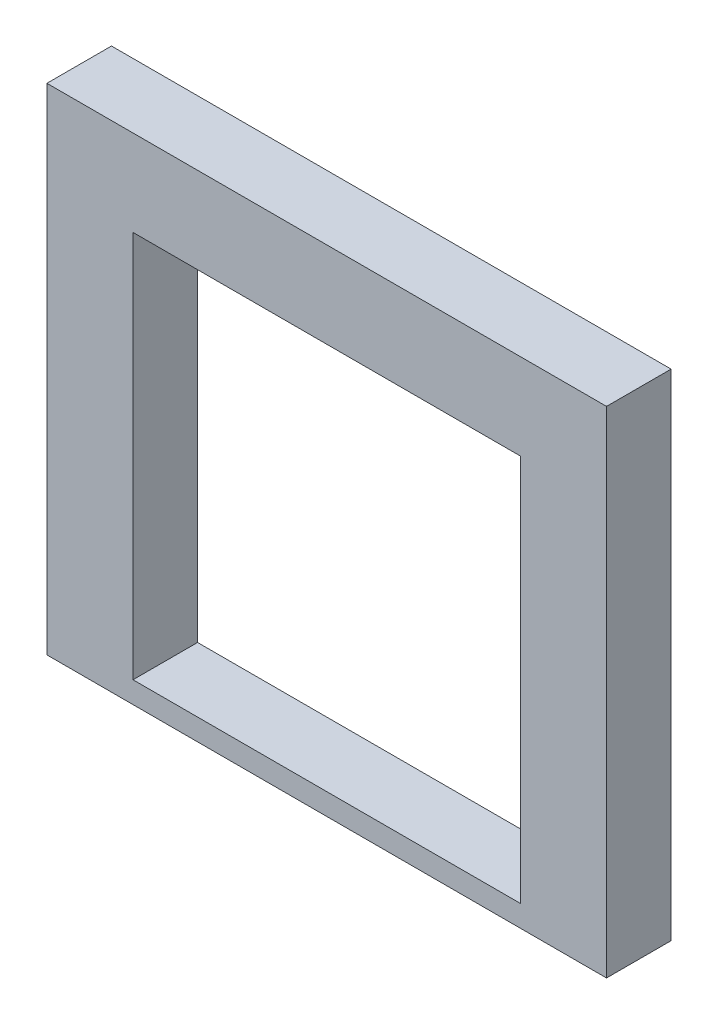
ISO-10303-21;
HEADER;
FILE_DESCRIPTION(('STEP AP214'),'2;1');
FILE_NAME('part.step','',(''),(''),'','','');
FILE_SCHEMA(('AUTOMOTIVE_DESIGN { 1 0 10303 214 1 1 1 1 }'));
ENDSEC;
DATA;
#1=APPLICATION_CONTEXT('core data for automotive mechanical design processes');
#2=APPLICATION_PROTOCOL_DEFINITION('international standard','automotive_design',2000,#1);
#3=PRODUCT_CONTEXT('',#1,'mechanical');
#4=PRODUCT('Part','Part','',(#3));
#5=PRODUCT_RELATED_PRODUCT_CATEGORY('part','',(#4));
#6=PRODUCT_DEFINITION_FORMATION('','',#4);
#7=PRODUCT_DEFINITION_CONTEXT('part definition',#1,'design');
#8=PRODUCT_DEFINITION('design','',#6,#7);
#9=PRODUCT_DEFINITION_SHAPE('','',#8);
#10=(LENGTH_UNIT() NAMED_UNIT(*) SI_UNIT(.MILLI.,.METRE.));
#11=(NAMED_UNIT(*) PLANE_ANGLE_UNIT() SI_UNIT($,.RADIAN.));
#12=(NAMED_UNIT(*) SI_UNIT($,.STERADIAN.) SOLID_ANGLE_UNIT());
#13=UNCERTAINTY_MEASURE_WITH_UNIT(LENGTH_MEASURE(1.E-05),#10,'distance_accuracy_value','');
#14=(GEOMETRIC_REPRESENTATION_CONTEXT(3) GLOBAL_UNCERTAINTY_ASSIGNED_CONTEXT((#13)) GLOBAL_UNIT_ASSIGNED_CONTEXT((#10,
#11,#12)) REPRESENTATION_CONTEXT('',''));
#15=CARTESIAN_POINT('',(0.,0.,0.));
#16=DIRECTION('',(0.,0.,1.));
#17=DIRECTION('',(1.,0.,0.));
#18=AXIS2_PLACEMENT_3D('',#15,#16,#17);
#19=CARTESIAN_POINT('',(0.,0.,1.5));
#20=DIRECTION('',(0.,0.,1.));
#21=DIRECTION('',(1.,0.,0.));
#22=AXIS2_PLACEMENT_3D('',#19,#20,#21);
#23=PLANE('',#22);
#24=DIRECTION('',(0.,-1.,0.));
#25=VECTOR('',#24,1.);
#26=CARTESIAN_POINT('',(-6.5,-5.,1.5));
#27=LINE('',#26,#25);
#28=CARTESIAN_POINT('',(-6.5,6.5,1.5));
#29=VERTEX_POINT('',#28);
#30=CARTESIAN_POINT('',(-6.5,-5.,1.5));
#31=VERTEX_POINT('',#30);
#32=EDGE_CURVE('E134',#29,#31,#27,.T.);
#33=ORIENTED_EDGE('',*,*,#32,.T.);
#34=DIRECTION('',(1.,0.,0.));
#35=VECTOR('',#34,1.);
#36=CARTESIAN_POINT('',(6.5,-5.,1.5));
#37=LINE('',#36,#35);
#38=CARTESIAN_POINT('',(6.5,-5.,1.5));
#39=VERTEX_POINT('',#38);
#40=EDGE_CURVE('E137',#31,#39,#37,.T.);
#41=ORIENTED_EDGE('',*,*,#40,.T.);
#42=DIRECTION('',(0.,1.,0.));
#43=VECTOR('',#42,1.);
#44=CARTESIAN_POINT('',(6.5,-5.,1.5));
#45=LINE('',#44,#43);
#46=CARTESIAN_POINT('',(6.5,6.5,1.5));
#47=VERTEX_POINT('',#46);
#48=EDGE_CURVE('E140',#39,#47,#45,.T.);
#49=ORIENTED_EDGE('',*,*,#48,.T.);
#50=DIRECTION('',(-1.,0.,0.));
#51=VECTOR('',#50,1.);
#52=CARTESIAN_POINT('',(6.5,6.5,1.5));
#53=LINE('',#52,#51);
#54=EDGE_CURVE('E142',#47,#29,#53,.T.);
#55=ORIENTED_EDGE('',*,*,#54,.T.);
#56=EDGE_LOOP('',(#33,#41,#49,#55));
#57=FACE_BOUND('',#56,.T.);
#58=DIRECTION('',(1.,0.,0.));
#59=VECTOR('',#58,1.);
#60=CARTESIAN_POINT('',(4.5,-4.5,1.5));
#61=LINE('',#60,#59);
#62=CARTESIAN_POINT('',(-4.5,-4.5,1.5));
#63=VERTEX_POINT('',#62);
#64=CARTESIAN_POINT('',(4.5,-4.5,1.5));
#65=VERTEX_POINT('',#64);
#66=EDGE_CURVE('E106',#63,#65,#61,.T.);
#67=ORIENTED_EDGE('',*,*,#66,.F.);
#68=DIRECTION('',(0.,-1.,0.));
#69=VECTOR('',#68,1.);
#70=CARTESIAN_POINT('',(-4.5,-4.5,1.5));
#71=LINE('',#70,#69);
#72=CARTESIAN_POINT('',(-4.5,4.5,1.5));
#73=VERTEX_POINT('',#72);
#74=EDGE_CURVE('E98',#73,#63,#71,.T.);
#75=ORIENTED_EDGE('',*,*,#74,.F.);
#76=DIRECTION('',(-1.,0.,0.));
#77=VECTOR('',#76,1.);
#78=CARTESIAN_POINT('',(4.5,4.5,1.5));
#79=LINE('',#78,#77);
#80=CARTESIAN_POINT('',(4.5,4.5,1.5));
#81=VERTEX_POINT('',#80);
#82=EDGE_CURVE('E120',#81,#73,#79,.T.);
#83=ORIENTED_EDGE('',*,*,#82,.F.);
#84=DIRECTION('',(0.,1.,0.));
#85=VECTOR('',#84,1.);
#86=CARTESIAN_POINT('',(4.5,-4.5,1.5));
#87=LINE('',#86,#85);
#88=EDGE_CURVE('E118',#65,#81,#87,.T.);
#89=ORIENTED_EDGE('',*,*,#88,.F.);
#90=EDGE_LOOP('',(#67,#75,#83,#89));
#91=FACE_BOUND('',#90,.T.);
#92=ADVANCED_FACE('F33',(#57,#91),#23,.T.);
#93=CARTESIAN_POINT('',(0.,0.,0.));
#94=DIRECTION('',(0.,0.,1.));
#95=DIRECTION('',(1.,0.,0.));
#96=AXIS2_PLACEMENT_3D('',#93,#94,#95);
#97=PLANE('',#96);
#98=DIRECTION('',(0.,-1.,0.));
#99=VECTOR('',#98,1.);
#100=CARTESIAN_POINT('',(-6.5,-5.,0.));
#101=LINE('',#100,#99);
#102=CARTESIAN_POINT('',(-6.5,6.5,0.));
#103=VERTEX_POINT('',#102);
#104=CARTESIAN_POINT('',(-6.5,-5.,0.));
#105=VERTEX_POINT('',#104);
#106=EDGE_CURVE('E114',#103,#105,#101,.T.);
#107=ORIENTED_EDGE('',*,*,#106,.F.);
#108=DIRECTION('',(-1.,0.,0.));
#109=VECTOR('',#108,1.);
#110=CARTESIAN_POINT('',(6.5,6.5,0.));
#111=LINE('',#110,#109);
#112=CARTESIAN_POINT('',(6.5,6.5,0.));
#113=VERTEX_POINT('',#112);
#114=EDGE_CURVE('E138',#113,#103,#111,.T.);
#115=ORIENTED_EDGE('',*,*,#114,.F.);
#116=DIRECTION('',(0.,1.,0.));
#117=VECTOR('',#116,1.);
#118=CARTESIAN_POINT('',(6.5,-5.,0.));
#119=LINE('',#118,#117);
#120=CARTESIAN_POINT('',(6.5,-5.,0.));
#121=VERTEX_POINT('',#120);
#122=EDGE_CURVE('E149',#121,#113,#119,.T.);
#123=ORIENTED_EDGE('',*,*,#122,.F.);
#124=DIRECTION('',(1.,0.,0.));
#125=VECTOR('',#124,1.);
#126=CARTESIAN_POINT('',(6.5,-5.,0.));
#127=LINE('',#126,#125);
#128=EDGE_CURVE('E147',#105,#121,#127,.T.);
#129=ORIENTED_EDGE('',*,*,#128,.F.);
#130=EDGE_LOOP('',(#107,#115,#123,#129));
#131=FACE_BOUND('',#130,.T.);
#132=DIRECTION('',(0.,-1.,0.));
#133=VECTOR('',#132,1.);
#134=CARTESIAN_POINT('',(-4.5,-4.5,0.));
#135=LINE('',#134,#133);
#136=CARTESIAN_POINT('',(-4.5,4.5,0.));
#137=VERTEX_POINT('',#136);
#138=CARTESIAN_POINT('',(-4.5,-4.5,0.));
#139=VERTEX_POINT('',#138);
#140=EDGE_CURVE('E56',#137,#139,#135,.T.);
#141=ORIENTED_EDGE('',*,*,#140,.T.);
#142=DIRECTION('',(1.,0.,0.));
#143=VECTOR('',#142,1.);
#144=CARTESIAN_POINT('',(4.5,-4.5,0.));
#145=LINE('',#144,#143);
#146=CARTESIAN_POINT('',(4.5,-4.5,0.));
#147=VERTEX_POINT('',#146);
#148=EDGE_CURVE('E113',#139,#147,#145,.T.);
#149=ORIENTED_EDGE('',*,*,#148,.T.);
#150=DIRECTION('',(0.,1.,0.));
#151=VECTOR('',#150,1.);
#152=CARTESIAN_POINT('',(4.5,-4.5,0.));
#153=LINE('',#152,#151);
#154=CARTESIAN_POINT('',(4.5,4.5,0.));
#155=VERTEX_POINT('',#154);
#156=EDGE_CURVE('E126',#147,#155,#153,.T.);
#157=ORIENTED_EDGE('',*,*,#156,.T.);
#158=DIRECTION('',(-1.,0.,0.));
#159=VECTOR('',#158,1.);
#160=CARTESIAN_POINT('',(4.5,4.5,0.));
#161=LINE('',#160,#159);
#162=EDGE_CURVE('E107',#155,#137,#161,.T.);
#163=ORIENTED_EDGE('',*,*,#162,.T.);
#164=EDGE_LOOP('',(#141,#149,#157,#163));
#165=FACE_BOUND('',#164,.T.);
#166=ADVANCED_FACE('F167',(#131,#165),#97,.F.);
#167=CARTESIAN_POINT('',(-6.5,-5.,1.5));
#168=DIRECTION('',(1.,0.,0.));
#169=DIRECTION('',(0.,0.,-1.));
#170=AXIS2_PLACEMENT_3D('',#167,#168,#169);
#171=PLANE('',#170);
#172=ORIENTED_EDGE('',*,*,#106,.T.);
#173=DIRECTION('',(0.,0.,-1.));
#174=VECTOR('',#173,1.);
#175=CARTESIAN_POINT('',(-6.5,-5.,1.5));
#176=LINE('',#175,#174);
#177=EDGE_CURVE('E11',#31,#105,#176,.T.);
#178=ORIENTED_EDGE('',*,*,#177,.F.);
#179=ORIENTED_EDGE('',*,*,#32,.F.);
#180=DIRECTION('',(0.,0.,-1.));
#181=VECTOR('',#180,1.);
#182=CARTESIAN_POINT('',(-6.5,6.5,1.5));
#183=LINE('',#182,#181);
#184=EDGE_CURVE('E144',#29,#103,#183,.T.);
#185=ORIENTED_EDGE('',*,*,#184,.T.);
#186=EDGE_LOOP('',(#172,#178,#179,#185));
#187=FACE_BOUND('',#186,.T.);
#188=ADVANCED_FACE('F35',(#187),#171,.F.);
#189=CARTESIAN_POINT('',(6.5,-5.,1.5));
#190=DIRECTION('',(0.,1.,0.));
#191=DIRECTION('',(-1.,0.,0.));
#192=AXIS2_PLACEMENT_3D('',#189,#190,#191);
#193=PLANE('',#192);
#194=ORIENTED_EDGE('',*,*,#128,.T.);
#195=DIRECTION('',(0.,0.,-1.));
#196=VECTOR('',#195,1.);
#197=CARTESIAN_POINT('',(6.5,-5.,1.5));
#198=LINE('',#197,#196);
#199=EDGE_CURVE('E41',#39,#121,#198,.T.);
#200=ORIENTED_EDGE('',*,*,#199,.F.);
#201=ORIENTED_EDGE('',*,*,#40,.F.);
#202=ORIENTED_EDGE('',*,*,#177,.T.);
#203=EDGE_LOOP('',(#194,#200,#201,#202));
#204=FACE_BOUND('',#203,.T.);
#205=ADVANCED_FACE('F177',(#204),#193,.F.);
#206=CARTESIAN_POINT('',(6.5,-5.,1.5));
#207=DIRECTION('',(-1.,0.,0.));
#208=DIRECTION('',(0.,0.,1.));
#209=AXIS2_PLACEMENT_3D('',#206,#207,#208);
#210=PLANE('',#209);
#211=ORIENTED_EDGE('',*,*,#122,.T.);
#212=DIRECTION('',(0.,0.,-1.));
#213=VECTOR('',#212,1.);
#214=CARTESIAN_POINT('',(6.5,6.5,1.5));
#215=LINE('',#214,#213);
#216=EDGE_CURVE('E154',#47,#113,#215,.T.);
#217=ORIENTED_EDGE('',*,*,#216,.F.);
#218=ORIENTED_EDGE('',*,*,#48,.F.);
#219=ORIENTED_EDGE('',*,*,#199,.T.);
#220=EDGE_LOOP('',(#211,#217,#218,#219));
#221=FACE_BOUND('',#220,.T.);
#222=ADVANCED_FACE('F161',(#221),#210,.F.);
#223=CARTESIAN_POINT('',(6.5,6.5,1.5));
#224=DIRECTION('',(0.,-1.,0.));
#225=DIRECTION('',(0.,0.,-1.));
#226=AXIS2_PLACEMENT_3D('',#223,#224,#225);
#227=PLANE('',#226);
#228=ORIENTED_EDGE('',*,*,#114,.T.);
#229=ORIENTED_EDGE('',*,*,#184,.F.);
#230=ORIENTED_EDGE('',*,*,#54,.F.);
#231=ORIENTED_EDGE('',*,*,#216,.T.);
#232=EDGE_LOOP('',(#228,#229,#230,#231));
#233=FACE_BOUND('',#232,.T.);
#234=ADVANCED_FACE('F171',(#233),#227,.F.);
#235=CARTESIAN_POINT('',(-4.5,-4.5,1.5));
#236=DIRECTION('',(1.,0.,0.));
#237=DIRECTION('',(0.,0.,-1.));
#238=AXIS2_PLACEMENT_3D('',#235,#236,#237);
#239=PLANE('',#238);
#240=ORIENTED_EDGE('',*,*,#140,.F.);
#241=DIRECTION('',(0.,0.,-1.));
#242=VECTOR('',#241,1.);
#243=CARTESIAN_POINT('',(-4.5,4.5,1.5));
#244=LINE('',#243,#242);
#245=EDGE_CURVE('E102',#73,#137,#244,.T.);
#246=ORIENTED_EDGE('',*,*,#245,.F.);
#247=ORIENTED_EDGE('',*,*,#74,.T.);
#248=DIRECTION('',(0.,0.,-1.));
#249=VECTOR('',#248,1.);
#250=CARTESIAN_POINT('',(-4.5,-4.5,1.5));
#251=LINE('',#250,#249);
#252=EDGE_CURVE('E101',#63,#139,#251,.T.);
#253=ORIENTED_EDGE('',*,*,#252,.T.);
#254=EDGE_LOOP('',(#240,#246,#247,#253));
#255=FACE_BOUND('',#254,.T.);
#256=ADVANCED_FACE('F100',(#255),#239,.T.);
#257=CARTESIAN_POINT('',(4.5,-4.5,1.5));
#258=DIRECTION('',(0.,1.,0.));
#259=DIRECTION('',(-1.,0.,0.));
#260=AXIS2_PLACEMENT_3D('',#257,#258,#259);
#261=PLANE('',#260);
#262=ORIENTED_EDGE('',*,*,#148,.F.);
#263=ORIENTED_EDGE('',*,*,#252,.F.);
#264=ORIENTED_EDGE('',*,*,#66,.T.);
#265=DIRECTION('',(0.,0.,-1.));
#266=VECTOR('',#265,1.);
#267=CARTESIAN_POINT('',(4.5,-4.5,1.5));
#268=LINE('',#267,#266);
#269=EDGE_CURVE('E115',#65,#147,#268,.T.);
#270=ORIENTED_EDGE('',*,*,#269,.T.);
#271=EDGE_LOOP('',(#262,#263,#264,#270));
#272=FACE_BOUND('',#271,.T.);
#273=ADVANCED_FACE('F110',(#272),#261,.T.);
#274=CARTESIAN_POINT('',(4.5,-4.5,1.5));
#275=DIRECTION('',(-1.,0.,0.));
#276=DIRECTION('',(0.,0.,1.));
#277=AXIS2_PLACEMENT_3D('',#274,#275,#276);
#278=PLANE('',#277);
#279=ORIENTED_EDGE('',*,*,#156,.F.);
#280=ORIENTED_EDGE('',*,*,#269,.F.);
#281=ORIENTED_EDGE('',*,*,#88,.T.);
#282=DIRECTION('',(0.,0.,-1.));
#283=VECTOR('',#282,1.);
#284=CARTESIAN_POINT('',(4.5,4.5,1.5));
#285=LINE('',#284,#283);
#286=EDGE_CURVE('E48',#81,#155,#285,.T.);
#287=ORIENTED_EDGE('',*,*,#286,.T.);
#288=EDGE_LOOP('',(#279,#280,#281,#287));
#289=FACE_BOUND('',#288,.T.);
#290=ADVANCED_FACE('F200',(#289),#278,.T.);
#291=CARTESIAN_POINT('',(4.5,4.5,1.5));
#292=DIRECTION('',(0.,-1.,0.));
#293=DIRECTION('',(1.,0.,0.));
#294=AXIS2_PLACEMENT_3D('',#291,#292,#293);
#295=PLANE('',#294);
#296=ORIENTED_EDGE('',*,*,#162,.F.);
#297=ORIENTED_EDGE('',*,*,#286,.F.);
#298=ORIENTED_EDGE('',*,*,#82,.T.);
#299=ORIENTED_EDGE('',*,*,#245,.T.);
#300=EDGE_LOOP('',(#296,#297,#298,#299));
#301=FACE_BOUND('',#300,.T.);
#302=ADVANCED_FACE('F204',(#301),#295,.T.);
#303=CLOSED_SHELL('',(#92,#166,#188,#205,#222,#234,#256,#273,#290,#302));
#304=MANIFOLD_SOLID_BREP('B2',#303);
#305=ADVANCED_BREP_SHAPE_REPRESENTATION('',(#18,#304),#14);
#306=SHAPE_DEFINITION_REPRESENTATION(#9,#305);
ENDSEC;
END-ISO-10303-21;
